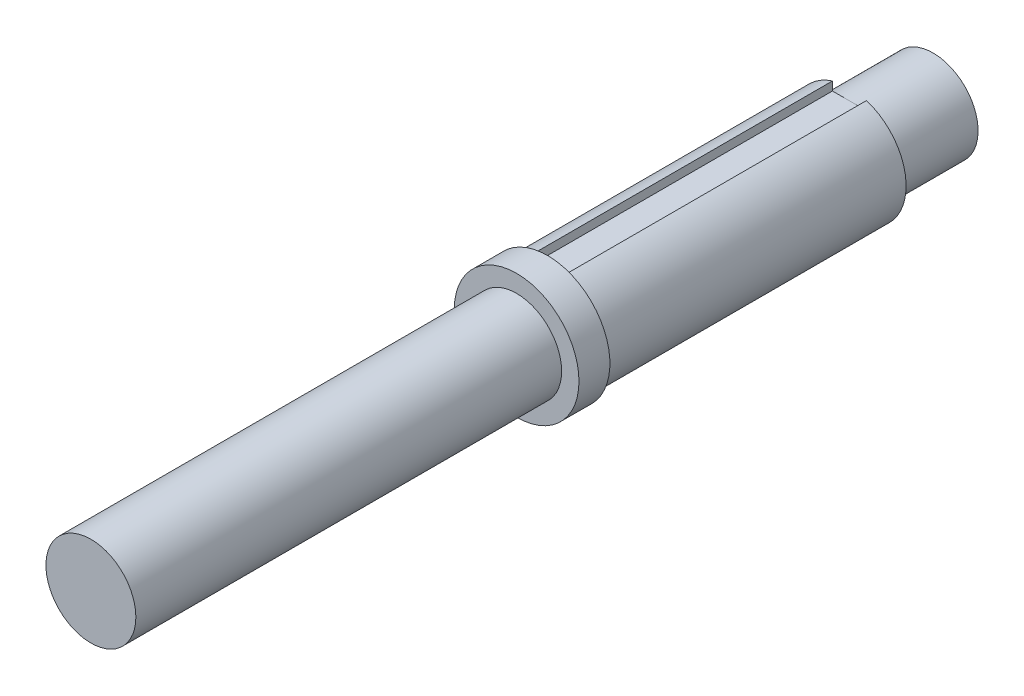
ISO-10303-21;
HEADER;
FILE_DESCRIPTION(('STEP AP214'),'2;1');
FILE_NAME('part.step','',(''),(''),'','','');
FILE_SCHEMA(('AUTOMOTIVE_DESIGN { 1 0 10303 214 1 1 1 1 }'));
ENDSEC;
DATA;
#1=APPLICATION_CONTEXT('core data for automotive mechanical design processes');
#2=APPLICATION_PROTOCOL_DEFINITION('international standard','automotive_design',2000,#1);
#3=PRODUCT_CONTEXT('',#1,'mechanical');
#4=PRODUCT('Part','Part','',(#3));
#5=PRODUCT_RELATED_PRODUCT_CATEGORY('part','',(#4));
#6=PRODUCT_DEFINITION_FORMATION('','',#4);
#7=PRODUCT_DEFINITION_CONTEXT('part definition',#1,'design');
#8=PRODUCT_DEFINITION('design','',#6,#7);
#9=PRODUCT_DEFINITION_SHAPE('','',#8);
#10=(LENGTH_UNIT() NAMED_UNIT(*) SI_UNIT(.MILLI.,.METRE.));
#11=(NAMED_UNIT(*) PLANE_ANGLE_UNIT() SI_UNIT($,.RADIAN.));
#12=(NAMED_UNIT(*) SI_UNIT($,.STERADIAN.) SOLID_ANGLE_UNIT());
#13=UNCERTAINTY_MEASURE_WITH_UNIT(LENGTH_MEASURE(1.E-05),#10,'distance_accuracy_value','');
#14=(GEOMETRIC_REPRESENTATION_CONTEXT(3) GLOBAL_UNCERTAINTY_ASSIGNED_CONTEXT((#13)) GLOBAL_UNIT_ASSIGNED_CONTEXT((#10,
#11,#12)) REPRESENTATION_CONTEXT('',''));
#15=CARTESIAN_POINT('',(0.,0.,0.));
#16=DIRECTION('',(0.,0.,1.));
#17=DIRECTION('',(1.,0.,0.));
#18=AXIS2_PLACEMENT_3D('',#15,#16,#17);
#19=CARTESIAN_POINT('',(0.,0.,93.36));
#20=DIRECTION('',(0.,0.,-1.));
#21=DIRECTION('',(-1.,0.,0.));
#22=AXIS2_PLACEMENT_3D('',#19,#20,#21);
#23=CYLINDRICAL_SURFACE('',#22,3.97);
#24=CARTESIAN_POINT('',(0.,0.,93.36));
#25=DIRECTION('',(0.,0.,-1.));
#26=DIRECTION('',(-1.,0.,0.));
#27=AXIS2_PLACEMENT_3D('',#24,#25,#26);
#28=CIRCLE('',#27,3.97);
#29=CARTESIAN_POINT('',(-3.97,0.,93.36));
#30=VERTEX_POINT('',#29);
#31=EDGE_CURVE('E172',#30,#30,#28,.T.);
#32=ORIENTED_EDGE('',*,*,#31,.T.);
#33=EDGE_LOOP('',(#32));
#34=FACE_BOUND('',#33,.T.);
#35=CARTESIAN_POINT('',(0.,0.,85.98));
#36=DIRECTION('',(0.,0.,-1.));
#37=DIRECTION('',(-1.,0.,0.));
#38=AXIS2_PLACEMENT_3D('',#35,#36,#37);
#39=CIRCLE('',#38,3.97);
#40=CARTESIAN_POINT('',(-3.97,0.,85.98));
#41=VERTEX_POINT('',#40);
#42=EDGE_CURVE('E41',#41,#41,#39,.F.);
#43=ORIENTED_EDGE('',*,*,#42,.T.);
#44=EDGE_LOOP('',(#43));
#45=FACE_BOUND('',#44,.T.);
#46=ADVANCED_FACE('F37',(#34,#45),#23,.T.);
#47=CARTESIAN_POINT('',(0.,0.,120.));
#48=DIRECTION('',(0.,0.,-1.));
#49=DIRECTION('',(-1.,0.,0.));
#50=AXIS2_PLACEMENT_3D('',#47,#48,#49);
#51=CYLINDRICAL_SURFACE('',#50,5.);
#52=DIRECTION('',(0.,0.,-1.));
#53=VECTOR('',#52,1.);
#54=CARTESIAN_POINT('',(-1.88367716829418,-4.63160450876877,120.));
#55=LINE('',#54,#53);
#56=CARTESIAN_POINT('',(-1.88367716829418,-4.63160450876877,120.));
#57=VERTEX_POINT('',#56);
#58=CARTESIAN_POINT('',(-1.88367716829418,-4.63160450876877,93.36));
#59=VERTEX_POINT('',#58);
#60=EDGE_CURVE('E152',#57,#59,#55,.T.);
#61=ORIENTED_EDGE('',*,*,#60,.F.);
#62=CARTESIAN_POINT('',(0.,0.,120.));
#63=DIRECTION('',(0.,0.,-1.));
#64=DIRECTION('',(-1.,0.,0.));
#65=AXIS2_PLACEMENT_3D('',#62,#63,#64);
#66=CIRCLE('',#65,5.);
#67=CARTESIAN_POINT('',(-1.5,4.76969600708473,120.));
#68=VERTEX_POINT('',#67);
#69=EDGE_CURVE('E188',#57,#68,#66,.T.);
#70=ORIENTED_EDGE('',*,*,#69,.T.);
#71=DIRECTION('',(0.,0.,-1.));
#72=VECTOR('',#71,1.);
#73=CARTESIAN_POINT('',(-1.5,4.76969600708473,120.));
#74=LINE('',#73,#72);
#75=CARTESIAN_POINT('',(-1.5,4.76969600708472,93.36));
#76=VERTEX_POINT('',#75);
#77=EDGE_CURVE('E169',#76,#68,#74,.F.);
#78=ORIENTED_EDGE('',*,*,#77,.F.);
#79=CARTESIAN_POINT('',(0.,0.,93.36));
#80=DIRECTION('',(0.,0.,-1.));
#81=DIRECTION('',(-1.,0.,0.));
#82=AXIS2_PLACEMENT_3D('',#79,#80,#81);
#83=CIRCLE('',#82,5.);
#84=EDGE_CURVE('E183',#76,#59,#83,.F.);
#85=ORIENTED_EDGE('',*,*,#84,.T.);
#86=EDGE_LOOP('',(#61,#70,#78,#85));
#87=FACE_BOUND('',#86,.T.);
#88=ADVANCED_FACE('F233',(#87),#51,.T.);
#89=DIRECTION('',(0.,0.,-1.));
#90=VECTOR('',#89,1.);
#91=CARTESIAN_POINT('',(1.88367716829418,-4.63160450876877,120.));
#92=LINE('',#91,#90);
#93=CARTESIAN_POINT('',(1.88367716829418,-4.63160450876877,93.36));
#94=VERTEX_POINT('',#93);
#95=CARTESIAN_POINT('',(1.88367716829418,-4.63160450876877,120.));
#96=VERTEX_POINT('',#95);
#97=EDGE_CURVE('E148',#94,#96,#92,.F.);
#98=ORIENTED_EDGE('',*,*,#97,.F.);
#99=CARTESIAN_POINT('',(1.5,4.76969600708473,93.36));
#100=VERTEX_POINT('',#99);
#101=EDGE_CURVE('E175',#94,#100,#83,.F.);
#102=ORIENTED_EDGE('',*,*,#101,.T.);
#103=DIRECTION('',(0.,0.,-1.));
#104=VECTOR('',#103,1.);
#105=CARTESIAN_POINT('',(1.5,4.76969600708473,120.));
#106=LINE('',#105,#104);
#107=CARTESIAN_POINT('',(1.5,4.76969600708473,120.));
#108=VERTEX_POINT('',#107);
#109=EDGE_CURVE('E165',#108,#100,#106,.T.);
#110=ORIENTED_EDGE('',*,*,#109,.F.);
#111=EDGE_CURVE('E184',#108,#96,#66,.T.);
#112=ORIENTED_EDGE('',*,*,#111,.T.);
#113=EDGE_LOOP('',(#98,#102,#110,#112));
#114=FACE_BOUND('',#113,.T.);
#115=ADVANCED_FACE('F208',(#114),#51,.T.);
#116=CARTESIAN_POINT('',(0.,0.,160.3));
#117=DIRECTION('',(0.,0.,-1.));
#118=DIRECTION('',(-1.,0.,0.));
#119=AXIS2_PLACEMENT_3D('',#116,#117,#118);
#120=CYLINDRICAL_SURFACE('',#119,5.5);
#121=CARTESIAN_POINT('',(0.,0.,120.));
#122=DIRECTION('',(0.,0.,-1.));
#123=DIRECTION('',(-1.,0.,0.));
#124=AXIS2_PLACEMENT_3D('',#121,#122,#123);
#125=CIRCLE('',#124,5.5);
#126=CARTESIAN_POINT('',(-5.5,0.,120.));
#127=VERTEX_POINT('',#126);
#128=EDGE_CURVE('E187',#127,#127,#125,.T.);
#129=ORIENTED_EDGE('',*,*,#128,.F.);
#130=EDGE_LOOP('',(#129));
#131=FACE_BOUND('',#130,.T.);
#132=CARTESIAN_POINT('',(0.,0.,122.73));
#133=DIRECTION('',(0.,0.,1.));
#134=DIRECTION('',(1.,0.,0.));
#135=AXIS2_PLACEMENT_3D('',#132,#133,#134);
#136=CIRCLE('',#135,5.5);
#137=CARTESIAN_POINT('',(5.5,0.,122.73));
#138=VERTEX_POINT('',#137);
#139=EDGE_CURVE('E179',#138,#138,#136,.T.);
#140=ORIENTED_EDGE('',*,*,#139,.F.);
#141=EDGE_LOOP('',(#140));
#142=FACE_BOUND('',#141,.T.);
#143=ADVANCED_FACE('F39',(#131,#142),#120,.T.);
#144=CARTESIAN_POINT('',(0.,0.,120.));
#145=DIRECTION('',(0.,0.,-1.));
#146=DIRECTION('',(-1.,0.,0.));
#147=AXIS2_PLACEMENT_3D('',#144,#145,#146);
#148=PLANE('',#147);
#149=DIRECTION('',(0.,1.,0.));
#150=VECTOR('',#149,1.);
#151=CARTESIAN_POINT('',(-1.88367716829418,0.,120.));
#152=LINE('',#151,#150);
#153=CARTESIAN_POINT('',(-1.88367716829418,-5.,120.));
#154=VERTEX_POINT('',#153);
#155=EDGE_CURVE('E154',#154,#57,#152,.T.);
#156=ORIENTED_EDGE('',*,*,#155,.F.);
#157=DIRECTION('',(1.,0.,0.));
#158=VECTOR('',#157,1.);
#159=CARTESIAN_POINT('',(0.,-5.,120.));
#160=LINE('',#159,#158);
#161=CARTESIAN_POINT('',(1.88367716829418,-5.,120.));
#162=VERTEX_POINT('',#161);
#163=EDGE_CURVE('E145',#154,#162,#160,.T.);
#164=ORIENTED_EDGE('',*,*,#163,.T.);
#165=DIRECTION('',(0.,-1.,0.));
#166=VECTOR('',#165,1.);
#167=CARTESIAN_POINT('',(1.88367716829418,0.,120.));
#168=LINE('',#167,#166);
#169=EDGE_CURVE('E150',#96,#162,#168,.T.);
#170=ORIENTED_EDGE('',*,*,#169,.F.);
#171=ORIENTED_EDGE('',*,*,#111,.F.);
#172=DIRECTION('',(0.,1.,0.));
#173=VECTOR('',#172,1.);
#174=CARTESIAN_POINT('',(1.5,4.,120.));
#175=LINE('',#174,#173);
#176=CARTESIAN_POINT('',(1.5,4.,120.));
#177=VERTEX_POINT('',#176);
#178=EDGE_CURVE('E161',#177,#108,#175,.T.);
#179=ORIENTED_EDGE('',*,*,#178,.F.);
#180=DIRECTION('',(1.,0.,0.));
#181=VECTOR('',#180,1.);
#182=CARTESIAN_POINT('',(1.5,4.,120.));
#183=LINE('',#182,#181);
#184=CARTESIAN_POINT('',(-1.5,4.,120.));
#185=VERTEX_POINT('',#184);
#186=EDGE_CURVE('E156',#185,#177,#183,.T.);
#187=ORIENTED_EDGE('',*,*,#186,.F.);
#188=DIRECTION('',(0.,1.,0.));
#189=VECTOR('',#188,1.);
#190=CARTESIAN_POINT('',(-1.5,4.,120.));
#191=LINE('',#190,#189);
#192=EDGE_CURVE('E162',#185,#68,#191,.T.);
#193=ORIENTED_EDGE('',*,*,#192,.T.);
#194=ORIENTED_EDGE('',*,*,#69,.F.);
#195=EDGE_LOOP('',(#156,#164,#170,#171,#179,#187,#193,#194));
#196=FACE_BOUND('',#195,.T.);
#197=ORIENTED_EDGE('',*,*,#128,.T.);
#198=EDGE_LOOP('',(#197));
#199=FACE_BOUND('',#198,.T.);
#200=ADVANCED_FACE('F220',(#196,#199),#148,.T.);
#201=CARTESIAN_POINT('',(0.,0.,122.73));
#202=DIRECTION('',(0.,0.,1.));
#203=DIRECTION('',(1.,0.,0.));
#204=AXIS2_PLACEMENT_3D('',#201,#202,#203);
#205=PLANE('',#204);
#206=CARTESIAN_POINT('',(0.,0.,122.73));
#207=DIRECTION('',(0.,0.,1.));
#208=DIRECTION('',(1.,0.,0.));
#209=AXIS2_PLACEMENT_3D('',#206,#207,#208);
#210=CIRCLE('',#209,3.96875);
#211=CARTESIAN_POINT('',(3.96875,0.,122.73));
#212=VERTEX_POINT('',#211);
#213=EDGE_CURVE('E176',#212,#212,#210,.T.);
#214=ORIENTED_EDGE('',*,*,#213,.F.);
#215=EDGE_LOOP('',(#214));
#216=FACE_BOUND('',#215,.T.);
#217=ORIENTED_EDGE('',*,*,#139,.T.);
#218=EDGE_LOOP('',(#217));
#219=FACE_BOUND('',#218,.T.);
#220=ADVANCED_FACE('F263',(#216,#219),#205,.T.);
#221=CARTESIAN_POINT('',(0.,0.,122.73));
#222=DIRECTION('',(0.,0.,1.));
#223=DIRECTION('',(1.,0.,0.));
#224=AXIS2_PLACEMENT_3D('',#221,#222,#223);
#225=CYLINDRICAL_SURFACE('',#224,3.96875);
#226=ORIENTED_EDGE('',*,*,#213,.T.);
#227=EDGE_LOOP('',(#226));
#228=FACE_BOUND('',#227,.T.);
#229=CARTESIAN_POINT('',(0.,0.,160.3));
#230=DIRECTION('',(0.,0.,1.));
#231=DIRECTION('',(1.,0.,0.));
#232=AXIS2_PLACEMENT_3D('',#229,#230,#231);
#233=CIRCLE('',#232,3.96875);
#234=CARTESIAN_POINT('',(3.96875,0.,160.3));
#235=VERTEX_POINT('',#234);
#236=EDGE_CURVE('E180',#235,#235,#233,.T.);
#237=ORIENTED_EDGE('',*,*,#236,.F.);
#238=EDGE_LOOP('',(#237));
#239=FACE_BOUND('',#238,.T.);
#240=ADVANCED_FACE('F260',(#228,#239),#225,.T.);
#241=CARTESIAN_POINT('',(0.,0.,160.3));
#242=DIRECTION('',(0.,0.,1.));
#243=DIRECTION('',(1.,0.,0.));
#244=AXIS2_PLACEMENT_3D('',#241,#242,#243);
#245=PLANE('',#244);
#246=ORIENTED_EDGE('',*,*,#236,.T.);
#247=EDGE_LOOP('',(#246));
#248=FACE_BOUND('',#247,.T.);
#249=ADVANCED_FACE('F259',(#248),#245,.T.);
#250=CARTESIAN_POINT('',(0.,0.,93.36));
#251=DIRECTION('',(0.,0.,-1.));
#252=DIRECTION('',(-1.,0.,0.));
#253=AXIS2_PLACEMENT_3D('',#250,#251,#252);
#254=PLANE('',#253);
#255=DIRECTION('',(0.,1.,0.));
#256=VECTOR('',#255,1.);
#257=CARTESIAN_POINT('',(-1.88367716829418,0.,93.36));
#258=LINE('',#257,#256);
#259=CARTESIAN_POINT('',(-1.88367716829418,-4.,93.36));
#260=VERTEX_POINT('',#259);
#261=EDGE_CURVE('E12',#59,#260,#258,.T.);
#262=ORIENTED_EDGE('',*,*,#261,.F.);
#263=ORIENTED_EDGE('',*,*,#84,.F.);
#264=DIRECTION('',(0.,1.,0.));
#265=VECTOR('',#264,1.);
#266=CARTESIAN_POINT('',(-1.5,0.,93.36));
#267=LINE('',#266,#265);
#268=CARTESIAN_POINT('',(-1.5,4.,93.36));
#269=VERTEX_POINT('',#268);
#270=EDGE_CURVE('E200',#269,#76,#267,.T.);
#271=ORIENTED_EDGE('',*,*,#270,.F.);
#272=DIRECTION('',(1.,0.,0.));
#273=VECTOR('',#272,1.);
#274=CARTESIAN_POINT('',(0.,4.,93.36));
#275=LINE('',#274,#273);
#276=CARTESIAN_POINT('',(1.5,4.,93.36));
#277=VERTEX_POINT('',#276);
#278=EDGE_CURVE('E191',#269,#277,#275,.T.);
#279=ORIENTED_EDGE('',*,*,#278,.T.);
#280=DIRECTION('',(0.,-1.,0.));
#281=VECTOR('',#280,1.);
#282=CARTESIAN_POINT('',(1.5,0.,93.36));
#283=LINE('',#282,#281);
#284=EDGE_CURVE('E198',#100,#277,#283,.T.);
#285=ORIENTED_EDGE('',*,*,#284,.F.);
#286=ORIENTED_EDGE('',*,*,#101,.F.);
#287=DIRECTION('',(0.,-1.,0.));
#288=VECTOR('',#287,1.);
#289=CARTESIAN_POINT('',(1.88367716829418,0.,93.36));
#290=LINE('',#289,#288);
#291=CARTESIAN_POINT('',(1.88367716829418,-4.,93.36));
#292=VERTEX_POINT('',#291);
#293=EDGE_CURVE('E46',#292,#94,#290,.T.);
#294=ORIENTED_EDGE('',*,*,#293,.F.);
#295=DIRECTION('',(1.,0.,0.));
#296=VECTOR('',#295,1.);
#297=CARTESIAN_POINT('',(0.,-4.,93.36));
#298=LINE('',#297,#296);
#299=EDGE_CURVE('E120',#260,#292,#298,.T.);
#300=ORIENTED_EDGE('',*,*,#299,.F.);
#301=EDGE_LOOP('',(#262,#263,#271,#279,#285,#286,#294,#300));
#302=FACE_BOUND('',#301,.T.);
#303=ORIENTED_EDGE('',*,*,#31,.F.);
#304=EDGE_LOOP('',(#303));
#305=FACE_BOUND('',#304,.T.);
#306=ADVANCED_FACE('F213',(#302,#305),#254,.T.);
#307=CARTESIAN_POINT('',(-1.5,4.,93.0000000000001));
#308=DIRECTION('',(-1.,0.,0.));
#309=DIRECTION('',(0.,0.,1.));
#310=AXIS2_PLACEMENT_3D('',#307,#308,#309);
#311=PLANE('',#310);
#312=ORIENTED_EDGE('',*,*,#77,.T.);
#313=ORIENTED_EDGE('',*,*,#192,.F.);
#314=DIRECTION('',(0.,0.,1.));
#315=VECTOR('',#314,1.);
#316=CARTESIAN_POINT('',(-1.5,4.,93.0000000000001));
#317=LINE('',#316,#315);
#318=EDGE_CURVE('E159',#269,#185,#317,.T.);
#319=ORIENTED_EDGE('',*,*,#318,.F.);
#320=ORIENTED_EDGE('',*,*,#270,.T.);
#321=EDGE_LOOP('',(#312,#313,#319,#320));
#322=FACE_BOUND('',#321,.T.);
#323=ADVANCED_FACE('F236',(#322),#311,.F.);
#324=CARTESIAN_POINT('',(1.5,4.,120.));
#325=DIRECTION('',(1.,0.,0.));
#326=DIRECTION('',(0.,0.,-1.));
#327=AXIS2_PLACEMENT_3D('',#324,#325,#326);
#328=PLANE('',#327);
#329=ORIENTED_EDGE('',*,*,#109,.T.);
#330=ORIENTED_EDGE('',*,*,#284,.T.);
#331=DIRECTION('',(0.,0.,-1.));
#332=VECTOR('',#331,1.);
#333=CARTESIAN_POINT('',(1.5,4.,120.));
#334=LINE('',#333,#332);
#335=EDGE_CURVE('E60',#177,#277,#334,.T.);
#336=ORIENTED_EDGE('',*,*,#335,.F.);
#337=ORIENTED_EDGE('',*,*,#178,.T.);
#338=EDGE_LOOP('',(#329,#330,#336,#337));
#339=FACE_BOUND('',#338,.T.);
#340=ADVANCED_FACE('F217',(#339),#328,.F.);
#341=CARTESIAN_POINT('',(0.,4.,0.));
#342=DIRECTION('',(0.,1.,0.));
#343=DIRECTION('',(0.,0.,1.));
#344=AXIS2_PLACEMENT_3D('',#341,#342,#343);
#345=PLANE('',#344);
#346=ORIENTED_EDGE('',*,*,#318,.T.);
#347=ORIENTED_EDGE('',*,*,#186,.T.);
#348=ORIENTED_EDGE('',*,*,#335,.T.);
#349=ORIENTED_EDGE('',*,*,#278,.F.);
#350=EDGE_LOOP('',(#346,#347,#348,#349));
#351=FACE_BOUND('',#350,.T.);
#352=ADVANCED_FACE('F238',(#351),#345,.T.);
#353=CARTESIAN_POINT('',(-1.88367716829418,-4.,93.0203438734206));
#354=DIRECTION('',(-1.,0.,0.));
#355=DIRECTION('',(0.,0.,1.));
#356=AXIS2_PLACEMENT_3D('',#353,#354,#355);
#357=PLANE('',#356);
#358=ORIENTED_EDGE('',*,*,#155,.T.);
#359=ORIENTED_EDGE('',*,*,#60,.T.);
#360=ORIENTED_EDGE('',*,*,#261,.T.);
#361=DIRECTION('',(0.,0.,-1.));
#362=VECTOR('',#361,1.);
#363=CARTESIAN_POINT('',(-1.88367716829418,-4.,93.0203438734206));
#364=LINE('',#363,#362);
#365=CARTESIAN_POINT('',(-1.88367716829418,-4.,120.020343873421));
#366=VERTEX_POINT('',#365);
#367=EDGE_CURVE('E53',#366,#260,#364,.T.);
#368=ORIENTED_EDGE('',*,*,#367,.F.);
#369=DIRECTION('',(0.,-1.,0.));
#370=VECTOR('',#369,1.);
#371=CARTESIAN_POINT('',(-1.88367716829418,-4.,120.020343873421));
#372=LINE('',#371,#370);
#373=CARTESIAN_POINT('',(-1.88367716829418,-5.,120.020343873421));
#374=VERTEX_POINT('',#373);
#375=EDGE_CURVE('E133',#366,#374,#372,.T.);
#376=ORIENTED_EDGE('',*,*,#375,.T.);
#377=DIRECTION('',(0.,0.,-1.));
#378=VECTOR('',#377,1.);
#379=CARTESIAN_POINT('',(-1.88367716829418,-5.,93.0203438734206));
#380=LINE('',#379,#378);
#381=EDGE_CURVE('E139',#374,#154,#380,.T.);
#382=ORIENTED_EDGE('',*,*,#381,.T.);
#383=EDGE_LOOP('',(#358,#359,#360,#368,#376,#382));
#384=FACE_BOUND('',#383,.T.);
#385=ADVANCED_FACE('F227',(#384),#357,.F.);
#386=CARTESIAN_POINT('',(-1.88367716829418,-4.,120.020343873421));
#387=DIRECTION('',(0.,0.,1.));
#388=DIRECTION('',(1.,0.,0.));
#389=AXIS2_PLACEMENT_3D('',#386,#387,#388);
#390=PLANE('',#389);
#391=DIRECTION('',(-1.,0.,0.));
#392=VECTOR('',#391,1.);
#393=CARTESIAN_POINT('',(-1.88367716829418,-5.,120.020343873421));
#394=LINE('',#393,#392);
#395=CARTESIAN_POINT('',(1.88367716829418,-5.,120.020343873421));
#396=VERTEX_POINT('',#395);
#397=EDGE_CURVE('E143',#396,#374,#394,.T.);
#398=ORIENTED_EDGE('',*,*,#397,.T.);
#399=ORIENTED_EDGE('',*,*,#375,.F.);
#400=DIRECTION('',(-1.,0.,0.));
#401=VECTOR('',#400,1.);
#402=CARTESIAN_POINT('',(-1.88367716829418,-4.,120.020343873421));
#403=LINE('',#402,#401);
#404=CARTESIAN_POINT('',(1.88367716829418,-4.,120.020343873421));
#405=VERTEX_POINT('',#404);
#406=EDGE_CURVE('E118',#405,#366,#403,.T.);
#407=ORIENTED_EDGE('',*,*,#406,.F.);
#408=DIRECTION('',(0.,-1.,0.));
#409=VECTOR('',#408,1.);
#410=CARTESIAN_POINT('',(1.88367716829418,-4.,120.020343873421));
#411=LINE('',#410,#409);
#412=EDGE_CURVE('E125',#405,#396,#411,.T.);
#413=ORIENTED_EDGE('',*,*,#412,.T.);
#414=EDGE_LOOP('',(#398,#399,#407,#413));
#415=FACE_BOUND('',#414,.T.);
#416=ADVANCED_FACE('F135',(#415),#390,.F.);
#417=CARTESIAN_POINT('',(1.88367716829418,-4.,120.020343873421));
#418=DIRECTION('',(1.,0.,0.));
#419=DIRECTION('',(0.,0.,-1.));
#420=AXIS2_PLACEMENT_3D('',#417,#418,#419);
#421=PLANE('',#420);
#422=ORIENTED_EDGE('',*,*,#169,.T.);
#423=DIRECTION('',(0.,0.,1.));
#424=VECTOR('',#423,1.);
#425=CARTESIAN_POINT('',(1.88367716829418,-5.,120.020343873421));
#426=LINE('',#425,#424);
#427=EDGE_CURVE('E129',#162,#396,#426,.T.);
#428=ORIENTED_EDGE('',*,*,#427,.T.);
#429=ORIENTED_EDGE('',*,*,#412,.F.);
#430=DIRECTION('',(0.,0.,1.));
#431=VECTOR('',#430,1.);
#432=CARTESIAN_POINT('',(1.88367716829418,-4.,120.020343873421));
#433=LINE('',#432,#431);
#434=EDGE_CURVE('E114',#292,#405,#433,.T.);
#435=ORIENTED_EDGE('',*,*,#434,.F.);
#436=ORIENTED_EDGE('',*,*,#293,.T.);
#437=ORIENTED_EDGE('',*,*,#97,.T.);
#438=EDGE_LOOP('',(#422,#428,#429,#435,#436,#437));
#439=FACE_BOUND('',#438,.T.);
#440=ADVANCED_FACE('F127',(#439),#421,.F.);
#441=CARTESIAN_POINT('',(0.,-4.,0.));
#442=DIRECTION('',(0.,1.,0.));
#443=DIRECTION('',(0.,0.,1.));
#444=AXIS2_PLACEMENT_3D('',#441,#442,#443);
#445=PLANE('',#444);
#446=ORIENTED_EDGE('',*,*,#299,.T.);
#447=ORIENTED_EDGE('',*,*,#434,.T.);
#448=ORIENTED_EDGE('',*,*,#406,.T.);
#449=ORIENTED_EDGE('',*,*,#367,.T.);
#450=EDGE_LOOP('',(#446,#447,#448,#449));
#451=FACE_BOUND('',#450,.T.);
#452=ADVANCED_FACE('F116',(#451),#445,.F.);
#453=CARTESIAN_POINT('',(0.,-5.,0.));
#454=DIRECTION('',(0.,1.,0.));
#455=DIRECTION('',(0.,0.,1.));
#456=AXIS2_PLACEMENT_3D('',#453,#454,#455);
#457=PLANE('',#456);
#458=ORIENTED_EDGE('',*,*,#381,.F.);
#459=ORIENTED_EDGE('',*,*,#397,.F.);
#460=ORIENTED_EDGE('',*,*,#427,.F.);
#461=ORIENTED_EDGE('',*,*,#163,.F.);
#462=EDGE_LOOP('',(#458,#459,#460,#461));
#463=FACE_BOUND('',#462,.T.);
#464=ADVANCED_FACE('F225',(#463),#457,.T.);
#465=CARTESIAN_POINT('',(0.,0.,85.98));
#466=DIRECTION('',(0.,0.,-1.));
#467=DIRECTION('',(-1.,0.,0.));
#468=AXIS2_PLACEMENT_3D('',#465,#466,#467);
#469=PLANE('',#468);
#470=ORIENTED_EDGE('',*,*,#42,.F.);
#471=EDGE_LOOP('',(#470));
#472=FACE_BOUND('',#471,.T.);
#473=ADVANCED_FACE('F380',(#472),#469,.T.);
#474=CLOSED_SHELL('',(#46,#88,#115,#143,#200,#220,#240,#249,#306,#323,#340,#352,#385,#416,#440,
#452,#464,#473));
#475=MANIFOLD_SOLID_BREP('B2',#474);
#476=ADVANCED_BREP_SHAPE_REPRESENTATION('',(#18,#475),#14);
#477=SHAPE_DEFINITION_REPRESENTATION(#9,#476);
ENDSEC;
END-ISO-10303-21;
